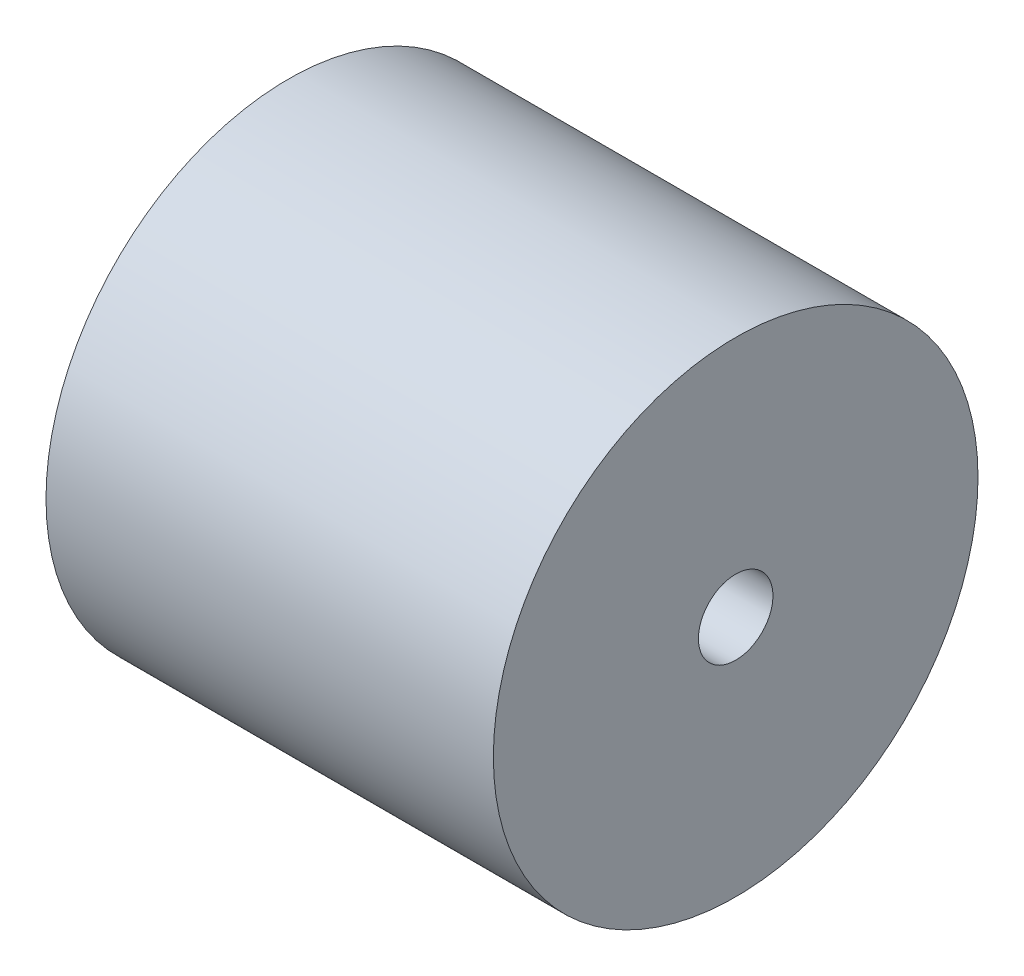
ISO-10303-21;
HEADER;
FILE_DESCRIPTION(('STEP AP214'),'2;1');
FILE_NAME('part.step','',(''),(''),'','','');
FILE_SCHEMA(('AUTOMOTIVE_DESIGN { 1 0 10303 214 1 1 1 1 }'));
ENDSEC;
DATA;
#1=APPLICATION_CONTEXT('core data for automotive mechanical design processes');
#2=APPLICATION_PROTOCOL_DEFINITION('international standard','automotive_design',2000,#1);
#3=PRODUCT_CONTEXT('',#1,'mechanical');
#4=PRODUCT('Part','Part','',(#3));
#5=PRODUCT_RELATED_PRODUCT_CATEGORY('part','',(#4));
#6=PRODUCT_DEFINITION_FORMATION('','',#4);
#7=PRODUCT_DEFINITION_CONTEXT('part definition',#1,'design');
#8=PRODUCT_DEFINITION('design','',#6,#7);
#9=PRODUCT_DEFINITION_SHAPE('','',#8);
#10=(LENGTH_UNIT() NAMED_UNIT(*) SI_UNIT(.MILLI.,.METRE.));
#11=(NAMED_UNIT(*) PLANE_ANGLE_UNIT() SI_UNIT($,.RADIAN.));
#12=(NAMED_UNIT(*) SI_UNIT($,.STERADIAN.) SOLID_ANGLE_UNIT());
#13=UNCERTAINTY_MEASURE_WITH_UNIT(LENGTH_MEASURE(1.E-05),#10,'distance_accuracy_value','');
#14=(GEOMETRIC_REPRESENTATION_CONTEXT(3) GLOBAL_UNCERTAINTY_ASSIGNED_CONTEXT((#13)) GLOBAL_UNIT_ASSIGNED_CONTEXT((#10,
#11,#12)) REPRESENTATION_CONTEXT('',''));
#15=CARTESIAN_POINT('',(0.,0.,0.));
#16=DIRECTION('',(0.,0.,1.));
#17=DIRECTION('',(1.,0.,0.));
#18=AXIS2_PLACEMENT_3D('',#15,#16,#17);
#19=CARTESIAN_POINT('',(0.,25.4,0.));
#20=DIRECTION('',(1.,0.,0.));
#21=DIRECTION('',(0.,0.,-1.));
#22=AXIS2_PLACEMENT_3D('',#19,#20,#21);
#23=PLANE('',#22);
#24=CARTESIAN_POINT('',(0.,0.,0.));
#25=DIRECTION('',(-1.,0.,0.));
#26=DIRECTION('',(0.,0.,1.));
#27=AXIS2_PLACEMENT_3D('',#24,#25,#26);
#28=CIRCLE('',#27,12.7);
#29=CARTESIAN_POINT('',(0.,0.,12.7));
#30=VERTEX_POINT('',#29);
#31=EDGE_CURVE('E84',#30,#30,#28,.T.);
#32=ORIENTED_EDGE('',*,*,#31,.F.);
#33=EDGE_LOOP('',(#32));
#34=FACE_BOUND('',#33,.T.);
#35=CARTESIAN_POINT('',(0.,0.,0.));
#36=DIRECTION('',(-1.,0.,0.));
#37=DIRECTION('',(0.,0.,1.));
#38=AXIS2_PLACEMENT_3D('',#35,#36,#37);
#39=CIRCLE('',#38,25.4);
#40=CARTESIAN_POINT('',(0.,0.,25.4));
#41=VERTEX_POINT('',#40);
#42=EDGE_CURVE('E10',#41,#41,#39,.T.);
#43=ORIENTED_EDGE('',*,*,#42,.T.);
#44=EDGE_LOOP('',(#43));
#45=FACE_BOUND('',#44,.T.);
#46=ADVANCED_FACE('F37',(#34,#45),#23,.F.);
#47=CARTESIAN_POINT('',(-9.27351198955822,0.,0.));
#48=DIRECTION('',(-1.,0.,0.));
#49=DIRECTION('',(0.,0.,1.));
#50=AXIS2_PLACEMENT_3D('',#47,#48,#49);
#51=TOROIDAL_SURFACE('',#50,25.7916904083534,9.2817803247263);
#52=ORIENTED_EDGE('',*,*,#42,.F.);
#53=EDGE_LOOP('',(#52));
#54=FACE_BOUND('',#53,.T.);
#55=CARTESIAN_POINT('',(-7.61999999999999,0.,0.));
#56=DIRECTION('',(-1.,0.,0.));
#57=DIRECTION('',(0.,0.,1.));
#58=AXIS2_PLACEMENT_3D('',#55,#56,#57);
#59=CIRCLE('',#58,34.925);
#60=CARTESIAN_POINT('',(-7.61999999999999,0.,34.925));
#61=VERTEX_POINT('',#60);
#62=EDGE_CURVE('E44',#61,#61,#59,.T.);
#63=ORIENTED_EDGE('',*,*,#62,.T.);
#64=EDGE_LOOP('',(#63));
#65=FACE_BOUND('',#64,.T.);
#66=ADVANCED_FACE('F92',(#54,#65),#51,.F.);
#67=CARTESIAN_POINT('',(0.,0.,0.));
#68=DIRECTION('',(-1.,0.,0.));
#69=DIRECTION('',(0.,0.,1.));
#70=AXIS2_PLACEMENT_3D('',#67,#68,#69);
#71=CYLINDRICAL_SURFACE('',#70,34.925);
#72=ORIENTED_EDGE('',*,*,#62,.F.);
#73=EDGE_LOOP('',(#72));
#74=FACE_BOUND('',#73,.T.);
#75=CARTESIAN_POINT('',(-24.13,0.,0.));
#76=DIRECTION('',(-1.,0.,0.));
#77=DIRECTION('',(0.,0.,1.));
#78=AXIS2_PLACEMENT_3D('',#75,#76,#77);
#79=CIRCLE('',#78,34.925);
#80=CARTESIAN_POINT('',(-24.13,0.,34.925));
#81=VERTEX_POINT('',#80);
#82=EDGE_CURVE('E49',#81,#81,#79,.T.);
#83=ORIENTED_EDGE('',*,*,#82,.T.);
#84=EDGE_LOOP('',(#83));
#85=FACE_BOUND('',#84,.T.);
#86=ADVANCED_FACE('F96',(#74,#85),#71,.F.);
#87=CARTESIAN_POINT('',(-22.22693630363,0.,0.));
#88=DIRECTION('',(-1.,0.,0.));
#89=DIRECTION('',(0.,0.,1.));
#90=AXIS2_PLACEMENT_3D('',#87,#88,#89);
#91=TOROIDAL_SURFACE('',#90,44.257950957096,9.525);
#92=ORIENTED_EDGE('',*,*,#82,.F.);
#93=EDGE_LOOP('',(#92));
#94=FACE_BOUND('',#93,.T.);
#95=CARTESIAN_POINT('',(-31.75,0.,0.));
#96=DIRECTION('',(-1.,0.,0.));
#97=DIRECTION('',(0.,0.,1.));
#98=AXIS2_PLACEMENT_3D('',#95,#96,#97);
#99=CIRCLE('',#98,44.45);
#100=CARTESIAN_POINT('',(-31.75,0.,44.45));
#101=VERTEX_POINT('',#100);
#102=EDGE_CURVE('E54',#101,#101,#99,.T.);
#103=ORIENTED_EDGE('',*,*,#102,.T.);
#104=EDGE_LOOP('',(#103));
#105=FACE_BOUND('',#104,.T.);
#106=ADVANCED_FACE('F101',(#94,#105),#91,.T.);
#107=CARTESIAN_POINT('',(-31.75,57.15,0.));
#108=DIRECTION('',(1.,0.,0.));
#109=DIRECTION('',(0.,0.,-1.));
#110=AXIS2_PLACEMENT_3D('',#107,#108,#109);
#111=PLANE('',#110);
#112=ORIENTED_EDGE('',*,*,#102,.F.);
#113=EDGE_LOOP('',(#112));
#114=FACE_BOUND('',#113,.T.);
#115=CARTESIAN_POINT('',(-31.75,0.,0.));
#116=DIRECTION('',(-1.,0.,0.));
#117=DIRECTION('',(0.,0.,1.));
#118=AXIS2_PLACEMENT_3D('',#115,#116,#117);
#119=CIRCLE('',#118,57.15);
#120=CARTESIAN_POINT('',(-31.75,0.,57.15));
#121=VERTEX_POINT('',#120);
#122=EDGE_CURVE('E60',#121,#121,#119,.T.);
#123=ORIENTED_EDGE('',*,*,#122,.T.);
#124=EDGE_LOOP('',(#123));
#125=FACE_BOUND('',#124,.T.);
#126=ADVANCED_FACE('F107',(#114,#125),#111,.F.);
#127=CARTESIAN_POINT('',(-44.45,0.,0.));
#128=DIRECTION('',(-1.,0.,0.));
#129=DIRECTION('',(0.,0.,1.));
#130=AXIS2_PLACEMENT_3D('',#127,#128,#129);
#131=TOROIDAL_SURFACE('',#130,57.15,12.7);
#132=ORIENTED_EDGE('',*,*,#122,.F.);
#133=EDGE_LOOP('',(#132));
#134=FACE_BOUND('',#133,.T.);
#135=CARTESIAN_POINT('',(-44.45,0.,0.));
#136=DIRECTION('',(-1.,0.,0.));
#137=DIRECTION('',(0.,0.,1.));
#138=AXIS2_PLACEMENT_3D('',#135,#136,#137);
#139=CIRCLE('',#138,69.85);
#140=CARTESIAN_POINT('',(-44.45,0.,69.85));
#141=VERTEX_POINT('',#140);
#142=EDGE_CURVE('E64',#141,#141,#139,.T.);
#143=ORIENTED_EDGE('',*,*,#142,.T.);
#144=EDGE_LOOP('',(#143));
#145=FACE_BOUND('',#144,.T.);
#146=ADVANCED_FACE('F111',(#134,#145),#131,.F.);
#147=CARTESIAN_POINT('',(0.,0.,0.));
#148=DIRECTION('',(-1.,0.,0.));
#149=DIRECTION('',(0.,0.,1.));
#150=AXIS2_PLACEMENT_3D('',#147,#148,#149);
#151=CYLINDRICAL_SURFACE('',#150,69.85);
#152=ORIENTED_EDGE('',*,*,#142,.F.);
#153=EDGE_LOOP('',(#152));
#154=FACE_BOUND('',#153,.T.);
#155=CARTESIAN_POINT('',(-50.8,0.,0.));
#156=DIRECTION('',(-1.,0.,0.));
#157=DIRECTION('',(0.,0.,1.));
#158=AXIS2_PLACEMENT_3D('',#155,#156,#157);
#159=CIRCLE('',#158,69.85);
#160=CARTESIAN_POINT('',(-50.8,0.,69.85));
#161=VERTEX_POINT('',#160);
#162=EDGE_CURVE('E68',#161,#161,#159,.T.);
#163=ORIENTED_EDGE('',*,*,#162,.T.);
#164=EDGE_LOOP('',(#163));
#165=FACE_BOUND('',#164,.T.);
#166=ADVANCED_FACE('F115',(#154,#165),#151,.F.);
#167=CARTESIAN_POINT('',(-50.8,69.85,0.));
#168=DIRECTION('',(1.,0.,0.));
#169=DIRECTION('',(0.,0.,-1.));
#170=AXIS2_PLACEMENT_3D('',#167,#168,#169);
#171=PLANE('',#170);
#172=ORIENTED_EDGE('',*,*,#162,.F.);
#173=EDGE_LOOP('',(#172));
#174=FACE_BOUND('',#173,.T.);
#175=CARTESIAN_POINT('',(-50.8,0.,0.));
#176=DIRECTION('',(-1.,0.,0.));
#177=DIRECTION('',(0.,0.,1.));
#178=AXIS2_PLACEMENT_3D('',#175,#176,#177);
#179=CIRCLE('',#178,82.55);
#180=CARTESIAN_POINT('',(-50.8,0.,82.55));
#181=VERTEX_POINT('',#180);
#182=EDGE_CURVE('E72',#181,#181,#179,.T.);
#183=ORIENTED_EDGE('',*,*,#182,.T.);
#184=EDGE_LOOP('',(#183));
#185=FACE_BOUND('',#184,.T.);
#186=ADVANCED_FACE('F119',(#174,#185),#171,.F.);
#187=CARTESIAN_POINT('',(0.,0.,0.));
#188=DIRECTION('',(-1.,0.,0.));
#189=DIRECTION('',(0.,0.,1.));
#190=AXIS2_PLACEMENT_3D('',#187,#188,#189);
#191=CYLINDRICAL_SURFACE('',#190,82.55);
#192=ORIENTED_EDGE('',*,*,#182,.F.);
#193=EDGE_LOOP('',(#192));
#194=FACE_BOUND('',#193,.T.);
#195=CARTESIAN_POINT('',(101.6,0.,0.));
#196=DIRECTION('',(-1.,0.,0.));
#197=DIRECTION('',(0.,0.,1.));
#198=AXIS2_PLACEMENT_3D('',#195,#196,#197);
#199=CIRCLE('',#198,82.55);
#200=CARTESIAN_POINT('',(101.6,0.,82.55));
#201=VERTEX_POINT('',#200);
#202=EDGE_CURVE('E76',#201,#201,#199,.T.);
#203=ORIENTED_EDGE('',*,*,#202,.T.);
#204=EDGE_LOOP('',(#203));
#205=FACE_BOUND('',#204,.T.);
#206=ADVANCED_FACE('F123',(#194,#205),#191,.T.);
#207=CARTESIAN_POINT('',(101.6,12.7,0.));
#208=DIRECTION('',(-1.,0.,0.));
#209=DIRECTION('',(0.,0.,1.));
#210=AXIS2_PLACEMENT_3D('',#207,#208,#209);
#211=PLANE('',#210);
#212=ORIENTED_EDGE('',*,*,#202,.F.);
#213=EDGE_LOOP('',(#212));
#214=FACE_BOUND('',#213,.T.);
#215=CARTESIAN_POINT('',(101.6,0.,0.));
#216=DIRECTION('',(-1.,0.,0.));
#217=DIRECTION('',(0.,0.,1.));
#218=AXIS2_PLACEMENT_3D('',#215,#216,#217);
#219=CIRCLE('',#218,12.7);
#220=CARTESIAN_POINT('',(101.6,0.,12.7));
#221=VERTEX_POINT('',#220);
#222=EDGE_CURVE('E80',#221,#221,#219,.T.);
#223=ORIENTED_EDGE('',*,*,#222,.T.);
#224=EDGE_LOOP('',(#223));
#225=FACE_BOUND('',#224,.T.);
#226=ADVANCED_FACE('F127',(#214,#225),#211,.F.);
#227=CARTESIAN_POINT('',(0.,0.,0.));
#228=DIRECTION('',(-1.,0.,0.));
#229=DIRECTION('',(0.,0.,1.));
#230=AXIS2_PLACEMENT_3D('',#227,#228,#229);
#231=CYLINDRICAL_SURFACE('',#230,12.7);
#232=ORIENTED_EDGE('',*,*,#222,.F.);
#233=EDGE_LOOP('',(#232));
#234=FACE_BOUND('',#233,.T.);
#235=ORIENTED_EDGE('',*,*,#31,.T.);
#236=EDGE_LOOP('',(#235));
#237=FACE_BOUND('',#236,.T.);
#238=ADVANCED_FACE('F89',(#234,#237),#231,.F.);
#239=CLOSED_SHELL('',(#46,#66,#86,#106,#126,#146,#166,#186,#206,#226,#238));
#240=MANIFOLD_SOLID_BREP('B2',#239);
#241=ADVANCED_BREP_SHAPE_REPRESENTATION('',(#18,#240),#14);
#242=SHAPE_DEFINITION_REPRESENTATION(#9,#241);
ENDSEC;
END-ISO-10303-21;
